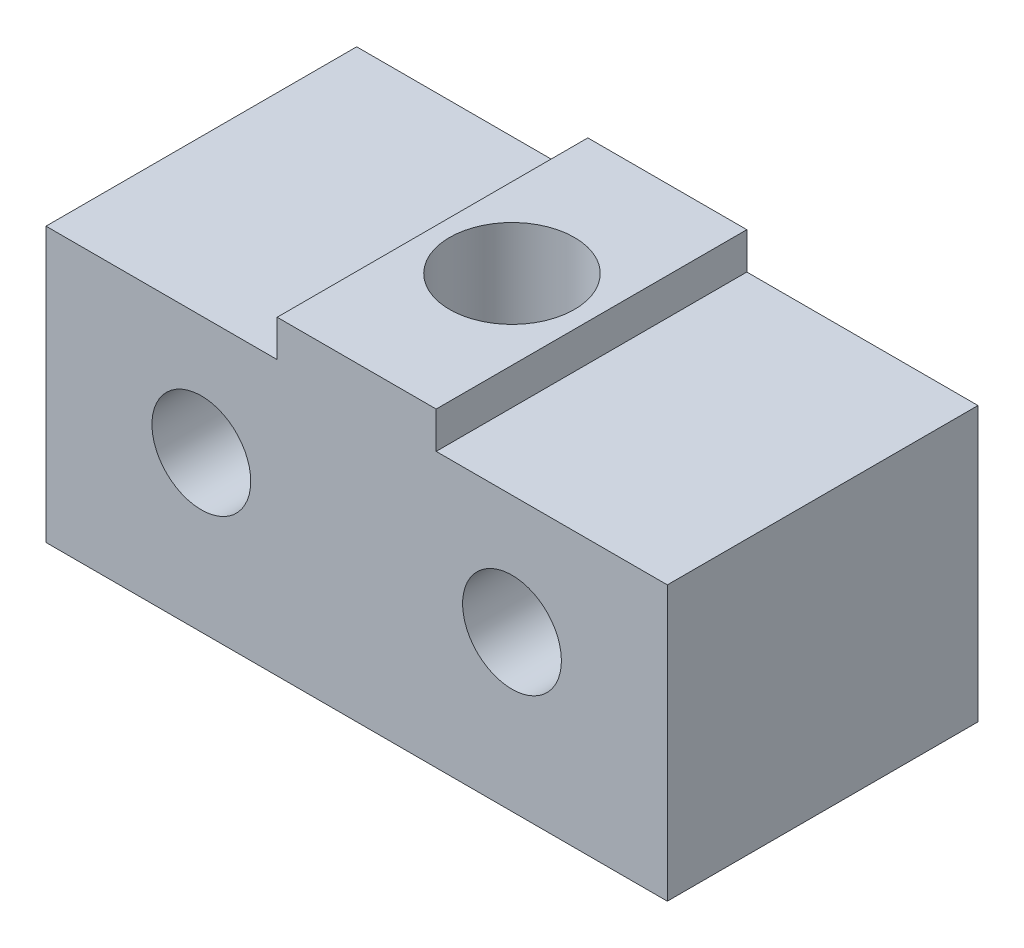
ISO-10303-21;
HEADER;
FILE_DESCRIPTION(('STEP AP214'),'2;1');
FILE_NAME('part.step','',(''),(''),'','','');
FILE_SCHEMA(('AUTOMOTIVE_DESIGN { 1 0 10303 214 1 1 1 1 }'));
ENDSEC;
DATA;
#1=APPLICATION_CONTEXT('core data for automotive mechanical design processes');
#2=APPLICATION_PROTOCOL_DEFINITION('international standard','automotive_design',2000,#1);
#3=PRODUCT_CONTEXT('',#1,'mechanical');
#4=PRODUCT('Part','Part','',(#3));
#5=PRODUCT_RELATED_PRODUCT_CATEGORY('part','',(#4));
#6=PRODUCT_DEFINITION_FORMATION('','',#4);
#7=PRODUCT_DEFINITION_CONTEXT('part definition',#1,'design');
#8=PRODUCT_DEFINITION('design','',#6,#7);
#9=PRODUCT_DEFINITION_SHAPE('','',#8);
#10=(LENGTH_UNIT() NAMED_UNIT(*) SI_UNIT(.MILLI.,.METRE.));
#11=(NAMED_UNIT(*) PLANE_ANGLE_UNIT() SI_UNIT($,.RADIAN.));
#12=(NAMED_UNIT(*) SI_UNIT($,.STERADIAN.) SOLID_ANGLE_UNIT());
#13=UNCERTAINTY_MEASURE_WITH_UNIT(LENGTH_MEASURE(1.E-05),#10,'distance_accuracy_value','');
#14=(GEOMETRIC_REPRESENTATION_CONTEXT(3) GLOBAL_UNCERTAINTY_ASSIGNED_CONTEXT((#13)) GLOBAL_UNIT_ASSIGNED_CONTEXT((#10,
#11,#12)) REPRESENTATION_CONTEXT('',''));
#15=CARTESIAN_POINT('',(0.,0.,0.));
#16=DIRECTION('',(0.,0.,1.));
#17=DIRECTION('',(1.,0.,0.));
#18=AXIS2_PLACEMENT_3D('',#15,#16,#17);
#19=CARTESIAN_POINT('',(0.,0.,12.7));
#20=DIRECTION('',(-1.,0.,0.));
#21=DIRECTION('',(0.,-1.,0.));
#22=AXIS2_PLACEMENT_3D('',#19,#20,#21);
#23=PLANE('',#22);
#24=DIRECTION('',(0.,1.,0.));
#25=VECTOR('',#24,1.);
#26=CARTESIAN_POINT('',(0.,0.,0.));
#27=LINE('',#26,#25);
#28=CARTESIAN_POINT('',(0.,-12.7,0.));
#29=VERTEX_POINT('',#28);
#30=CARTESIAN_POINT('',(0.,-1.5,0.));
#31=VERTEX_POINT('',#30);
#32=EDGE_CURVE('E188',#29,#31,#27,.T.);
#33=ORIENTED_EDGE('',*,*,#32,.T.);
#34=DIRECTION('',(0.,0.,1.));
#35=VECTOR('',#34,1.);
#36=CARTESIAN_POINT('',(0.,-1.5,-9.56830706029024));
#37=LINE('',#36,#35);
#38=CARTESIAN_POINT('',(0.,-1.5,12.7));
#39=VERTEX_POINT('',#38);
#40=EDGE_CURVE('E72',#31,#39,#37,.T.);
#41=ORIENTED_EDGE('',*,*,#40,.T.);
#42=DIRECTION('',(0.,1.,0.));
#43=VECTOR('',#42,1.);
#44=CARTESIAN_POINT('',(0.,0.,12.7));
#45=LINE('',#44,#43);
#46=CARTESIAN_POINT('',(0.,-12.7,12.7));
#47=VERTEX_POINT('',#46);
#48=EDGE_CURVE('E189',#47,#39,#45,.T.);
#49=ORIENTED_EDGE('',*,*,#48,.F.);
#50=DIRECTION('',(0.,0.,-1.));
#51=VECTOR('',#50,1.);
#52=CARTESIAN_POINT('',(0.,-12.7,12.7));
#53=LINE('',#52,#51);
#54=EDGE_CURVE('E57',#47,#29,#53,.T.);
#55=ORIENTED_EDGE('',*,*,#54,.T.);
#56=EDGE_LOOP('',(#33,#41,#49,#55));
#57=FACE_BOUND('',#56,.T.);
#58=ADVANCED_FACE('F49',(#57),#23,.F.);
#59=CARTESIAN_POINT('',(0.,0.,12.7));
#60=DIRECTION('',(0.,-1.,0.));
#61=DIRECTION('',(0.,0.,-1.));
#62=AXIS2_PLACEMENT_3D('',#59,#60,#61);
#63=PLANE('',#62);
#64=CARTESIAN_POINT('',(-12.7,0.,6.35));
#65=DIRECTION('',(0.,-1.,0.));
#66=DIRECTION('',(0.,0.,-1.));
#67=AXIS2_PLACEMENT_3D('',#64,#65,#66);
#68=CIRCLE('',#67,2.5527);
#69=CARTESIAN_POINT('',(-12.7,0.,3.7973));
#70=VERTEX_POINT('',#69);
#71=EDGE_CURVE('E158',#70,#70,#68,.T.);
#72=ORIENTED_EDGE('',*,*,#71,.T.);
#73=EDGE_LOOP('',(#72));
#74=FACE_BOUND('',#73,.T.);
#75=DIRECTION('',(-1.,0.,0.));
#76=VECTOR('',#75,1.);
#77=CARTESIAN_POINT('',(0.,0.,0.));
#78=LINE('',#77,#76);
#79=CARTESIAN_POINT('',(-9.45,0.,0.));
#80=VERTEX_POINT('',#79);
#81=CARTESIAN_POINT('',(-15.95,0.,0.));
#82=VERTEX_POINT('',#81);
#83=EDGE_CURVE('E206',#80,#82,#78,.T.);
#84=ORIENTED_EDGE('',*,*,#83,.T.);
#85=DIRECTION('',(0.,0.,1.));
#86=VECTOR('',#85,1.);
#87=CARTESIAN_POINT('',(-15.95,0.,-9.56830706029024));
#88=LINE('',#87,#86);
#89=CARTESIAN_POINT('',(-15.95,0.,12.7));
#90=VERTEX_POINT('',#89);
#91=EDGE_CURVE('E64',#82,#90,#88,.T.);
#92=ORIENTED_EDGE('',*,*,#91,.T.);
#93=DIRECTION('',(-1.,0.,0.));
#94=VECTOR('',#93,1.);
#95=CARTESIAN_POINT('',(0.,0.,12.7));
#96=LINE('',#95,#94);
#97=CARTESIAN_POINT('',(-9.45,0.,12.7));
#98=VERTEX_POINT('',#97);
#99=EDGE_CURVE('E192',#98,#90,#96,.T.);
#100=ORIENTED_EDGE('',*,*,#99,.F.);
#101=DIRECTION('',(0.,0.,1.));
#102=VECTOR('',#101,1.);
#103=CARTESIAN_POINT('',(-9.45,0.,-9.56830706029024));
#104=LINE('',#103,#102);
#105=EDGE_CURVE('E154',#80,#98,#104,.T.);
#106=ORIENTED_EDGE('',*,*,#105,.F.);
#107=EDGE_LOOP('',(#84,#92,#100,#106));
#108=FACE_BOUND('',#107,.T.);
#109=ADVANCED_FACE('F255',(#74,#108),#63,.F.);
#110=CARTESIAN_POINT('',(-25.4,0.,12.7));
#111=DIRECTION('',(1.,0.,0.));
#112=DIRECTION('',(0.,0.,-1.));
#113=AXIS2_PLACEMENT_3D('',#110,#111,#112);
#114=PLANE('',#113);
#115=DIRECTION('',(0.,-1.,0.));
#116=VECTOR('',#115,1.);
#117=CARTESIAN_POINT('',(-25.4,0.,12.7));
#118=LINE('',#117,#116);
#119=CARTESIAN_POINT('',(-25.4,-1.5,12.7));
#120=VERTEX_POINT('',#119);
#121=CARTESIAN_POINT('',(-25.4,-12.7,12.7));
#122=VERTEX_POINT('',#121);
#123=EDGE_CURVE('E197',#120,#122,#118,.T.);
#124=ORIENTED_EDGE('',*,*,#123,.F.);
#125=DIRECTION('',(0.,0.,1.));
#126=VECTOR('',#125,1.);
#127=CARTESIAN_POINT('',(-25.4,-1.5,-9.56830706029024));
#128=LINE('',#127,#126);
#129=CARTESIAN_POINT('',(-25.4,-1.5,0.));
#130=VERTEX_POINT('',#129);
#131=EDGE_CURVE('E146',#130,#120,#128,.T.);
#132=ORIENTED_EDGE('',*,*,#131,.F.);
#133=DIRECTION('',(0.,-1.,0.));
#134=VECTOR('',#133,1.);
#135=CARTESIAN_POINT('',(-25.4,0.,0.));
#136=LINE('',#135,#134);
#137=CARTESIAN_POINT('',(-25.4,-12.7,0.));
#138=VERTEX_POINT('',#137);
#139=EDGE_CURVE('E135',#130,#138,#136,.T.);
#140=ORIENTED_EDGE('',*,*,#139,.T.);
#141=DIRECTION('',(0.,0.,-1.));
#142=VECTOR('',#141,1.);
#143=CARTESIAN_POINT('',(-25.4,-12.7,12.7));
#144=LINE('',#143,#142);
#145=EDGE_CURVE('E13',#122,#138,#144,.T.);
#146=ORIENTED_EDGE('',*,*,#145,.F.);
#147=EDGE_LOOP('',(#124,#132,#140,#146));
#148=FACE_BOUND('',#147,.T.);
#149=ADVANCED_FACE('F234',(#148),#114,.F.);
#150=CARTESIAN_POINT('',(0.,-12.7,12.7));
#151=DIRECTION('',(0.,1.,0.));
#152=DIRECTION('',(-1.,0.,0.));
#153=AXIS2_PLACEMENT_3D('',#150,#151,#152);
#154=PLANE('',#153);
#155=CARTESIAN_POINT('',(-12.7,-12.7,6.35));
#156=DIRECTION('',(0.,-1.,0.));
#157=DIRECTION('',(0.,0.,-1.));
#158=AXIS2_PLACEMENT_3D('',#155,#156,#157);
#159=CIRCLE('',#158,4.7625);
#160=CARTESIAN_POINT('',(-12.7,-12.7,1.5875));
#161=VERTEX_POINT('',#160);
#162=EDGE_CURVE('E238',#161,#161,#159,.T.);
#163=ORIENTED_EDGE('',*,*,#162,.F.);
#164=EDGE_LOOP('',(#163));
#165=FACE_BOUND('',#164,.T.);
#166=DIRECTION('',(1.,0.,0.));
#167=VECTOR('',#166,1.);
#168=CARTESIAN_POINT('',(0.,-12.7,0.));
#169=LINE('',#168,#167);
#170=EDGE_CURVE('E193',#138,#29,#169,.T.);
#171=ORIENTED_EDGE('',*,*,#170,.T.);
#172=ORIENTED_EDGE('',*,*,#54,.F.);
#173=DIRECTION('',(1.,0.,0.));
#174=VECTOR('',#173,1.);
#175=CARTESIAN_POINT('',(0.,-12.7,12.7));
#176=LINE('',#175,#174);
#177=EDGE_CURVE('E200',#122,#47,#176,.T.);
#178=ORIENTED_EDGE('',*,*,#177,.F.);
#179=ORIENTED_EDGE('',*,*,#145,.T.);
#180=EDGE_LOOP('',(#171,#172,#178,#179));
#181=FACE_BOUND('',#180,.T.);
#182=ADVANCED_FACE('F232',(#165,#181),#154,.F.);
#183=CARTESIAN_POINT('',(0.,0.,12.7));
#184=DIRECTION('',(0.,0.,-1.));
#185=DIRECTION('',(-1.,0.,0.));
#186=AXIS2_PLACEMENT_3D('',#183,#184,#185);
#187=PLANE('',#186);
#188=CARTESIAN_POINT('',(-6.35,-6.35,12.7));
#189=DIRECTION('',(0.,0.,1.));
#190=DIRECTION('',(1.,0.,0.));
#191=AXIS2_PLACEMENT_3D('',#188,#189,#190);
#192=CIRCLE('',#191,2.0193);
#193=CARTESIAN_POINT('',(-4.3307,-6.35,12.7));
#194=VERTEX_POINT('',#193);
#195=EDGE_CURVE('E150',#194,#194,#192,.T.);
#196=ORIENTED_EDGE('',*,*,#195,.F.);
#197=EDGE_LOOP('',(#196));
#198=FACE_BOUND('',#197,.T.);
#199=CARTESIAN_POINT('',(-19.05,-6.35,12.7));
#200=DIRECTION('',(0.,0.,1.));
#201=DIRECTION('',(1.,0.,0.));
#202=AXIS2_PLACEMENT_3D('',#199,#200,#201);
#203=CIRCLE('',#202,2.0193);
#204=CARTESIAN_POINT('',(-17.0307,-6.35,12.7));
#205=VERTEX_POINT('',#204);
#206=EDGE_CURVE('E180',#205,#205,#203,.T.);
#207=ORIENTED_EDGE('',*,*,#206,.F.);
#208=EDGE_LOOP('',(#207));
#209=FACE_BOUND('',#208,.T.);
#210=DIRECTION('',(0.,1.,0.));
#211=VECTOR('',#210,1.);
#212=CARTESIAN_POINT('',(-15.95,0.,12.7));
#213=LINE('',#212,#211);
#214=CARTESIAN_POINT('',(-15.95,-1.5,12.7));
#215=VERTEX_POINT('',#214);
#216=EDGE_CURVE('E137',#215,#90,#213,.T.);
#217=ORIENTED_EDGE('',*,*,#216,.F.);
#218=DIRECTION('',(1.,0.,0.));
#219=VECTOR('',#218,1.);
#220=CARTESIAN_POINT('',(-25.4,-1.5,12.7));
#221=LINE('',#220,#219);
#222=EDGE_CURVE('E127',#120,#215,#221,.T.);
#223=ORIENTED_EDGE('',*,*,#222,.F.);
#224=ORIENTED_EDGE('',*,*,#123,.T.);
#225=ORIENTED_EDGE('',*,*,#177,.T.);
#226=ORIENTED_EDGE('',*,*,#48,.T.);
#227=DIRECTION('',(1.,0.,0.));
#228=VECTOR('',#227,1.);
#229=CARTESIAN_POINT('',(0.,-1.5,12.7));
#230=LINE('',#229,#228);
#231=CARTESIAN_POINT('',(-9.45,-1.5,12.7));
#232=VERTEX_POINT('',#231);
#233=EDGE_CURVE('E151',#232,#39,#230,.T.);
#234=ORIENTED_EDGE('',*,*,#233,.F.);
#235=DIRECTION('',(0.,-1.,0.));
#236=VECTOR('',#235,1.);
#237=CARTESIAN_POINT('',(-9.45,0.,12.7));
#238=LINE('',#237,#236);
#239=EDGE_CURVE('E155',#98,#232,#238,.T.);
#240=ORIENTED_EDGE('',*,*,#239,.F.);
#241=ORIENTED_EDGE('',*,*,#99,.T.);
#242=EDGE_LOOP('',(#217,#223,#224,#225,#226,#234,#240,#241));
#243=FACE_BOUND('',#242,.T.);
#244=ADVANCED_FACE('F229',(#198,#209,#243),#187,.F.);
#245=CARTESIAN_POINT('',(0.,0.,0.));
#246=DIRECTION('',(0.,0.,-1.));
#247=DIRECTION('',(-1.,0.,0.));
#248=AXIS2_PLACEMENT_3D('',#245,#246,#247);
#249=PLANE('',#248);
#250=DIRECTION('',(1.,0.,0.));
#251=VECTOR('',#250,1.);
#252=CARTESIAN_POINT('',(-25.4,-1.5,0.));
#253=LINE('',#252,#251);
#254=CARTESIAN_POINT('',(-15.95,-1.5,0.));
#255=VERTEX_POINT('',#254);
#256=EDGE_CURVE('E124',#130,#255,#253,.T.);
#257=ORIENTED_EDGE('',*,*,#256,.T.);
#258=DIRECTION('',(0.,1.,0.));
#259=VECTOR('',#258,1.);
#260=CARTESIAN_POINT('',(-15.95,0.,0.));
#261=LINE('',#260,#259);
#262=EDGE_CURVE('E111',#255,#82,#261,.T.);
#263=ORIENTED_EDGE('',*,*,#262,.T.);
#264=ORIENTED_EDGE('',*,*,#83,.F.);
#265=DIRECTION('',(0.,-1.,0.));
#266=VECTOR('',#265,1.);
#267=CARTESIAN_POINT('',(-9.45,0.,0.));
#268=LINE('',#267,#266);
#269=CARTESIAN_POINT('',(-9.45,-1.5,0.));
#270=VERTEX_POINT('',#269);
#271=EDGE_CURVE('E163',#80,#270,#268,.T.);
#272=ORIENTED_EDGE('',*,*,#271,.T.);
#273=DIRECTION('',(1.,0.,0.));
#274=VECTOR('',#273,1.);
#275=CARTESIAN_POINT('',(0.,-1.5,0.));
#276=LINE('',#275,#274);
#277=EDGE_CURVE('E159',#270,#31,#276,.T.);
#278=ORIENTED_EDGE('',*,*,#277,.T.);
#279=ORIENTED_EDGE('',*,*,#32,.F.);
#280=ORIENTED_EDGE('',*,*,#170,.F.);
#281=ORIENTED_EDGE('',*,*,#139,.F.);
#282=EDGE_LOOP('',(#257,#263,#264,#272,#278,#279,#280,#281));
#283=FACE_BOUND('',#282,.T.);
#284=CARTESIAN_POINT('',(-6.35,-6.35,0.));
#285=DIRECTION('',(0.,0.,1.));
#286=DIRECTION('',(1.,0.,0.));
#287=AXIS2_PLACEMENT_3D('',#284,#285,#286);
#288=CIRCLE('',#287,2.0193);
#289=CARTESIAN_POINT('',(-4.3307,-6.35,0.));
#290=VERTEX_POINT('',#289);
#291=EDGE_CURVE('E176',#290,#290,#288,.T.);
#292=ORIENTED_EDGE('',*,*,#291,.T.);
#293=EDGE_LOOP('',(#292));
#294=FACE_BOUND('',#293,.T.);
#295=CARTESIAN_POINT('',(-19.05,-6.35,0.));
#296=DIRECTION('',(0.,0.,1.));
#297=DIRECTION('',(1.,0.,0.));
#298=AXIS2_PLACEMENT_3D('',#295,#296,#297);
#299=CIRCLE('',#298,2.0193);
#300=CARTESIAN_POINT('',(-17.0307,-6.35,0.));
#301=VERTEX_POINT('',#300);
#302=EDGE_CURVE('E184',#301,#301,#299,.T.);
#303=ORIENTED_EDGE('',*,*,#302,.T.);
#304=EDGE_LOOP('',(#303));
#305=FACE_BOUND('',#304,.T.);
#306=ADVANCED_FACE('F132',(#283,#294,#305),#249,.T.);
#307=CARTESIAN_POINT('',(-19.05,-6.35,12.7));
#308=DIRECTION('',(0.,0.,1.));
#309=DIRECTION('',(1.,0.,0.));
#310=AXIS2_PLACEMENT_3D('',#307,#308,#309);
#311=CYLINDRICAL_SURFACE('',#310,2.0193);
#312=ORIENTED_EDGE('',*,*,#302,.F.);
#313=EDGE_LOOP('',(#312));
#314=FACE_BOUND('',#313,.T.);
#315=ORIENTED_EDGE('',*,*,#206,.T.);
#316=EDGE_LOOP('',(#315));
#317=FACE_BOUND('',#316,.T.);
#318=ADVANCED_FACE('F289',(#314,#317),#311,.F.);
#319=CARTESIAN_POINT('',(-6.35,-6.35,12.7));
#320=DIRECTION('',(0.,0.,1.));
#321=DIRECTION('',(1.,0.,0.));
#322=AXIS2_PLACEMENT_3D('',#319,#320,#321);
#323=CYLINDRICAL_SURFACE('',#322,2.0193);
#324=ORIENTED_EDGE('',*,*,#291,.F.);
#325=EDGE_LOOP('',(#324));
#326=FACE_BOUND('',#325,.T.);
#327=ORIENTED_EDGE('',*,*,#195,.T.);
#328=EDGE_LOOP('',(#327));
#329=FACE_BOUND('',#328,.T.);
#330=ADVANCED_FACE('F295',(#326,#329),#323,.F.);
#331=CARTESIAN_POINT('',(-9.45,0.,-9.56830706029024));
#332=DIRECTION('',(-1.,0.,0.));
#333=DIRECTION('',(0.,-1.,0.));
#334=AXIS2_PLACEMENT_3D('',#331,#332,#333);
#335=PLANE('',#334);
#336=ORIENTED_EDGE('',*,*,#105,.T.);
#337=ORIENTED_EDGE('',*,*,#239,.T.);
#338=DIRECTION('',(0.,0.,1.));
#339=VECTOR('',#338,1.);
#340=CARTESIAN_POINT('',(-9.45,-1.5,-9.56830706029024));
#341=LINE('',#340,#339);
#342=EDGE_CURVE('E162',#270,#232,#341,.T.);
#343=ORIENTED_EDGE('',*,*,#342,.F.);
#344=ORIENTED_EDGE('',*,*,#271,.F.);
#345=EDGE_LOOP('',(#336,#337,#343,#344));
#346=FACE_BOUND('',#345,.T.);
#347=ADVANCED_FACE('F223',(#346),#335,.F.);
#348=CARTESIAN_POINT('',(0.,-1.5,-9.56830706029024));
#349=DIRECTION('',(0.,-1.,0.));
#350=DIRECTION('',(1.,0.,0.));
#351=AXIS2_PLACEMENT_3D('',#348,#349,#350);
#352=PLANE('',#351);
#353=ORIENTED_EDGE('',*,*,#342,.T.);
#354=ORIENTED_EDGE('',*,*,#233,.T.);
#355=ORIENTED_EDGE('',*,*,#40,.F.);
#356=ORIENTED_EDGE('',*,*,#277,.F.);
#357=EDGE_LOOP('',(#353,#354,#355,#356));
#358=FACE_BOUND('',#357,.T.);
#359=ADVANCED_FACE('F221',(#358),#352,.F.);
#360=CARTESIAN_POINT('',(-25.4,-1.5,-9.56830706029024));
#361=DIRECTION('',(0.,-1.,0.));
#362=DIRECTION('',(0.,0.,-1.));
#363=AXIS2_PLACEMENT_3D('',#360,#361,#362);
#364=PLANE('',#363);
#365=ORIENTED_EDGE('',*,*,#131,.T.);
#366=ORIENTED_EDGE('',*,*,#222,.T.);
#367=DIRECTION('',(0.,0.,1.));
#368=VECTOR('',#367,1.);
#369=CARTESIAN_POINT('',(-15.95,-1.5,-9.56830706029024));
#370=LINE('',#369,#368);
#371=EDGE_CURVE('E114',#255,#215,#370,.T.);
#372=ORIENTED_EDGE('',*,*,#371,.F.);
#373=ORIENTED_EDGE('',*,*,#256,.F.);
#374=EDGE_LOOP('',(#365,#366,#372,#373));
#375=FACE_BOUND('',#374,.T.);
#376=ADVANCED_FACE('F123',(#375),#364,.F.);
#377=CARTESIAN_POINT('',(-15.95,0.,-9.56830706029024));
#378=DIRECTION('',(1.,0.,0.));
#379=DIRECTION('',(0.,0.,-1.));
#380=AXIS2_PLACEMENT_3D('',#377,#378,#379);
#381=PLANE('',#380);
#382=ORIENTED_EDGE('',*,*,#371,.T.);
#383=ORIENTED_EDGE('',*,*,#216,.T.);
#384=ORIENTED_EDGE('',*,*,#91,.F.);
#385=ORIENTED_EDGE('',*,*,#262,.F.);
#386=EDGE_LOOP('',(#382,#383,#384,#385));
#387=FACE_BOUND('',#386,.T.);
#388=ADVANCED_FACE('F113',(#387),#381,.F.);
#389=CARTESIAN_POINT('',(-12.7,-12.7,6.35));
#390=DIRECTION('',(0.,-1.,0.));
#391=DIRECTION('',(0.,0.,-1.));
#392=AXIS2_PLACEMENT_3D('',#389,#390,#391);
#393=CYLINDRICAL_SURFACE('',#392,2.5527);
#394=ORIENTED_EDGE('',*,*,#71,.F.);
#395=EDGE_LOOP('',(#394));
#396=FACE_BOUND('',#395,.T.);
#397=CARTESIAN_POINT('',(-12.7,-7.874,6.35));
#398=DIRECTION('',(0.,-1.,0.));
#399=DIRECTION('',(0.,0.,-1.));
#400=AXIS2_PLACEMENT_3D('',#397,#398,#399);
#401=CIRCLE('',#400,2.5527);
#402=CARTESIAN_POINT('',(-12.7,-7.874,3.7973));
#403=VERTEX_POINT('',#402);
#404=EDGE_CURVE('E246',#403,#403,#401,.T.);
#405=ORIENTED_EDGE('',*,*,#404,.T.);
#406=EDGE_LOOP('',(#405));
#407=FACE_BOUND('',#406,.T.);
#408=ADVANCED_FACE('F258',(#396,#407),#393,.F.);
#409=CARTESIAN_POINT('',(-10.1473,-7.874,6.35));
#410=DIRECTION('',(0.,1.,0.));
#411=DIRECTION('',(0.,0.,1.));
#412=AXIS2_PLACEMENT_3D('',#409,#410,#411);
#413=PLANE('',#412);
#414=ORIENTED_EDGE('',*,*,#404,.F.);
#415=EDGE_LOOP('',(#414));
#416=FACE_BOUND('',#415,.T.);
#417=CARTESIAN_POINT('',(-12.7,-7.874,6.35));
#418=DIRECTION('',(0.,-1.,0.));
#419=DIRECTION('',(0.,0.,-1.));
#420=AXIS2_PLACEMENT_3D('',#417,#418,#419);
#421=CIRCLE('',#420,4.7625);
#422=CARTESIAN_POINT('',(-12.7,-7.874,1.5875));
#423=VERTEX_POINT('',#422);
#424=EDGE_CURVE('E240',#423,#423,#421,.T.);
#425=ORIENTED_EDGE('',*,*,#424,.T.);
#426=EDGE_LOOP('',(#425));
#427=FACE_BOUND('',#426,.T.);
#428=ADVANCED_FACE('F261',(#416,#427),#413,.F.);
#429=CARTESIAN_POINT('',(-12.7,-12.7,6.35));
#430=DIRECTION('',(0.,-1.,0.));
#431=DIRECTION('',(0.,0.,-1.));
#432=AXIS2_PLACEMENT_3D('',#429,#430,#431);
#433=CYLINDRICAL_SURFACE('',#432,4.7625);
#434=ORIENTED_EDGE('',*,*,#424,.F.);
#435=EDGE_LOOP('',(#434));
#436=FACE_BOUND('',#435,.T.);
#437=ORIENTED_EDGE('',*,*,#162,.T.);
#438=EDGE_LOOP('',(#437));
#439=FACE_BOUND('',#438,.T.);
#440=ADVANCED_FACE('F267',(#436,#439),#433,.F.);
#441=CLOSED_SHELL('',(#58,#109,#149,#182,#244,#306,#318,#330,#347,#359,#376,#388,#408,#428,#440));
#442=MANIFOLD_SOLID_BREP('B2',#441);
#443=ADVANCED_BREP_SHAPE_REPRESENTATION('',(#18,#442),#14);
#444=SHAPE_DEFINITION_REPRESENTATION(#9,#443);
ENDSEC;
END-ISO-10303-21;
